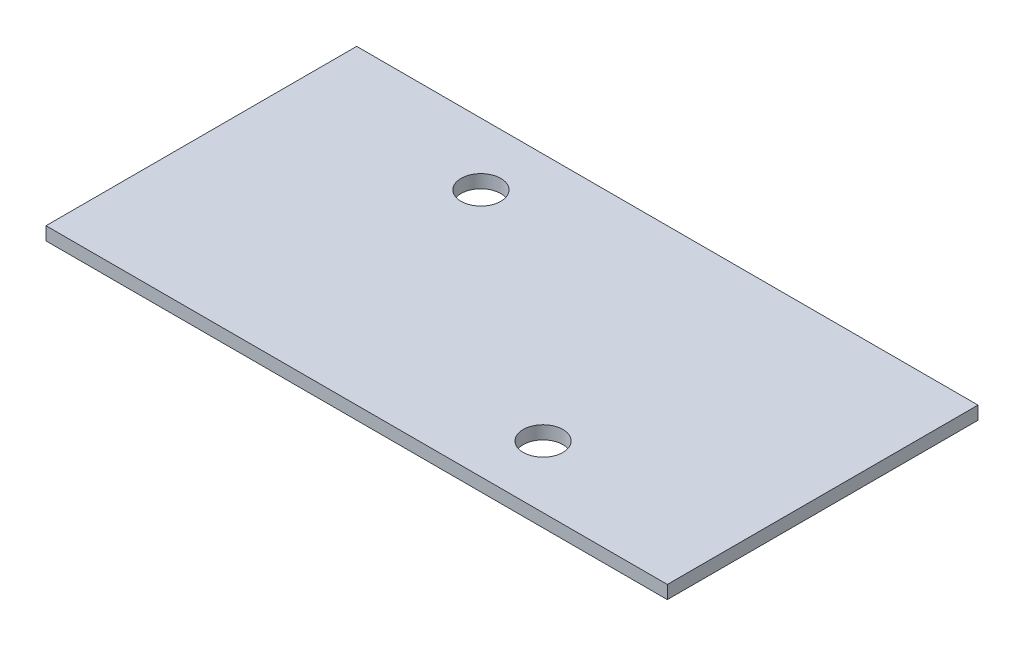
ISO-10303-21;
HEADER;
FILE_DESCRIPTION(('STEP AP214'),'2;1');
FILE_NAME('part.step','',(''),(''),'','','');
FILE_SCHEMA(('AUTOMOTIVE_DESIGN { 1 0 10303 214 1 1 1 1 }'));
ENDSEC;
DATA;
#1=APPLICATION_CONTEXT('core data for automotive mechanical design processes');
#2=APPLICATION_PROTOCOL_DEFINITION('international standard','automotive_design',2000,#1);
#3=PRODUCT_CONTEXT('',#1,'mechanical');
#4=PRODUCT('Part','Part','',(#3));
#5=PRODUCT_RELATED_PRODUCT_CATEGORY('part','',(#4));
#6=PRODUCT_DEFINITION_FORMATION('','',#4);
#7=PRODUCT_DEFINITION_CONTEXT('part definition',#1,'design');
#8=PRODUCT_DEFINITION('design','',#6,#7);
#9=PRODUCT_DEFINITION_SHAPE('','',#8);
#10=(LENGTH_UNIT() NAMED_UNIT(*) SI_UNIT(.MILLI.,.METRE.));
#11=(NAMED_UNIT(*) PLANE_ANGLE_UNIT() SI_UNIT($,.RADIAN.));
#12=(NAMED_UNIT(*) SI_UNIT($,.STERADIAN.) SOLID_ANGLE_UNIT());
#13=UNCERTAINTY_MEASURE_WITH_UNIT(LENGTH_MEASURE(1.E-05),#10,'distance_accuracy_value','');
#14=(GEOMETRIC_REPRESENTATION_CONTEXT(3) GLOBAL_UNCERTAINTY_ASSIGNED_CONTEXT((#13)) GLOBAL_UNIT_ASSIGNED_CONTEXT((#10,
#11,#12)) REPRESENTATION_CONTEXT('',''));
#15=CARTESIAN_POINT('',(0.,0.,0.));
#16=DIRECTION('',(0.,0.,1.));
#17=DIRECTION('',(1.,0.,0.));
#18=AXIS2_PLACEMENT_3D('',#15,#16,#17);
#19=CARTESIAN_POINT('',(25.,1.06,-12.5));
#20=DIRECTION('',(-1.,0.,0.));
#21=DIRECTION('',(0.,0.,1.));
#22=AXIS2_PLACEMENT_3D('',#19,#20,#21);
#23=PLANE('',#22);
#24=DIRECTION('',(0.,0.,-1.));
#25=VECTOR('',#24,1.);
#26=CARTESIAN_POINT('',(25.,0.,-12.5));
#27=LINE('',#26,#25);
#28=CARTESIAN_POINT('',(25.,0.,12.5));
#29=VERTEX_POINT('',#28);
#30=CARTESIAN_POINT('',(25.,0.,-12.5));
#31=VERTEX_POINT('',#30);
#32=EDGE_CURVE('E97',#29,#31,#27,.T.);
#33=ORIENTED_EDGE('',*,*,#32,.T.);
#34=DIRECTION('',(0.,-1.,0.));
#35=VECTOR('',#34,1.);
#36=CARTESIAN_POINT('',(25.,1.06,-12.5));
#37=LINE('',#36,#35);
#38=CARTESIAN_POINT('',(25.,1.06,-12.5));
#39=VERTEX_POINT('',#38);
#40=EDGE_CURVE('E11',#39,#31,#37,.T.);
#41=ORIENTED_EDGE('',*,*,#40,.F.);
#42=DIRECTION('',(0.,0.,-1.));
#43=VECTOR('',#42,1.);
#44=CARTESIAN_POINT('',(25.,1.06,-12.5));
#45=LINE('',#44,#43);
#46=CARTESIAN_POINT('',(25.,1.06,12.5));
#47=VERTEX_POINT('',#46);
#48=EDGE_CURVE('E85',#47,#39,#45,.T.);
#49=ORIENTED_EDGE('',*,*,#48,.F.);
#50=DIRECTION('',(0.,-1.,0.));
#51=VECTOR('',#50,1.);
#52=CARTESIAN_POINT('',(25.,1.06,12.5));
#53=LINE('',#52,#51);
#54=EDGE_CURVE('E93',#47,#29,#53,.T.);
#55=ORIENTED_EDGE('',*,*,#54,.T.);
#56=EDGE_LOOP('',(#33,#41,#49,#55));
#57=FACE_BOUND('',#56,.T.);
#58=ADVANCED_FACE('F34',(#57),#23,.F.);
#59=CARTESIAN_POINT('',(-25.,1.06,-12.5));
#60=DIRECTION('',(0.,0.,1.));
#61=DIRECTION('',(1.,0.,0.));
#62=AXIS2_PLACEMENT_3D('',#59,#60,#61);
#63=PLANE('',#62);
#64=DIRECTION('',(-1.,0.,0.));
#65=VECTOR('',#64,1.);
#66=CARTESIAN_POINT('',(-25.,0.,-12.5));
#67=LINE('',#66,#65);
#68=CARTESIAN_POINT('',(-25.,0.,-12.5));
#69=VERTEX_POINT('',#68);
#70=EDGE_CURVE('E89',#31,#69,#67,.T.);
#71=ORIENTED_EDGE('',*,*,#70,.T.);
#72=DIRECTION('',(0.,-1.,0.));
#73=VECTOR('',#72,1.);
#74=CARTESIAN_POINT('',(-25.,1.06,-12.5));
#75=LINE('',#74,#73);
#76=CARTESIAN_POINT('',(-25.,1.06,-12.5));
#77=VERTEX_POINT('',#76);
#78=EDGE_CURVE('E42',#77,#69,#75,.T.);
#79=ORIENTED_EDGE('',*,*,#78,.F.);
#80=DIRECTION('',(-1.,0.,0.));
#81=VECTOR('',#80,1.);
#82=CARTESIAN_POINT('',(-25.,1.06,-12.5));
#83=LINE('',#82,#81);
#84=EDGE_CURVE('E80',#39,#77,#83,.T.);
#85=ORIENTED_EDGE('',*,*,#84,.F.);
#86=ORIENTED_EDGE('',*,*,#40,.T.);
#87=EDGE_LOOP('',(#71,#79,#85,#86));
#88=FACE_BOUND('',#87,.T.);
#89=ADVANCED_FACE('F88',(#88),#63,.F.);
#90=CARTESIAN_POINT('',(-25.,1.06,-12.5));
#91=DIRECTION('',(1.,0.,0.));
#92=DIRECTION('',(0.,0.,-1.));
#93=AXIS2_PLACEMENT_3D('',#90,#91,#92);
#94=PLANE('',#93);
#95=DIRECTION('',(0.,0.,1.));
#96=VECTOR('',#95,1.);
#97=CARTESIAN_POINT('',(-25.,0.,-12.5));
#98=LINE('',#97,#96);
#99=CARTESIAN_POINT('',(-25.,0.,12.5));
#100=VERTEX_POINT('',#99);
#101=EDGE_CURVE('E67',#69,#100,#98,.T.);
#102=ORIENTED_EDGE('',*,*,#101,.T.);
#103=DIRECTION('',(0.,-1.,0.));
#104=VECTOR('',#103,1.);
#105=CARTESIAN_POINT('',(-25.,1.06,12.5));
#106=LINE('',#105,#104);
#107=CARTESIAN_POINT('',(-25.,1.06,12.5));
#108=VERTEX_POINT('',#107);
#109=EDGE_CURVE('E90',#108,#100,#106,.T.);
#110=ORIENTED_EDGE('',*,*,#109,.F.);
#111=DIRECTION('',(0.,0.,1.));
#112=VECTOR('',#111,1.);
#113=CARTESIAN_POINT('',(-25.,1.06,-12.5));
#114=LINE('',#113,#112);
#115=EDGE_CURVE('E83',#77,#108,#114,.T.);
#116=ORIENTED_EDGE('',*,*,#115,.F.);
#117=ORIENTED_EDGE('',*,*,#78,.T.);
#118=EDGE_LOOP('',(#102,#110,#116,#117));
#119=FACE_BOUND('',#118,.T.);
#120=ADVANCED_FACE('F91',(#119),#94,.F.);
#121=CARTESIAN_POINT('',(-25.,1.06,12.5));
#122=DIRECTION('',(0.,0.,-1.));
#123=DIRECTION('',(-1.,0.,0.));
#124=AXIS2_PLACEMENT_3D('',#121,#122,#123);
#125=PLANE('',#124);
#126=DIRECTION('',(1.,0.,0.));
#127=VECTOR('',#126,1.);
#128=CARTESIAN_POINT('',(-25.,0.,12.5));
#129=LINE('',#128,#127);
#130=EDGE_CURVE('E73',#100,#29,#129,.T.);
#131=ORIENTED_EDGE('',*,*,#130,.T.);
#132=ORIENTED_EDGE('',*,*,#54,.F.);
#133=DIRECTION('',(1.,0.,0.));
#134=VECTOR('',#133,1.);
#135=CARTESIAN_POINT('',(-25.,1.06,12.5));
#136=LINE('',#135,#134);
#137=EDGE_CURVE('E50',#108,#47,#136,.T.);
#138=ORIENTED_EDGE('',*,*,#137,.F.);
#139=ORIENTED_EDGE('',*,*,#109,.T.);
#140=EDGE_LOOP('',(#131,#132,#138,#139));
#141=FACE_BOUND('',#140,.T.);
#142=ADVANCED_FACE('F105',(#141),#125,.F.);
#143=CARTESIAN_POINT('',(0.,1.06,0.));
#144=DIRECTION('',(0.,1.,0.));
#145=DIRECTION('',(0.,0.,1.));
#146=AXIS2_PLACEMENT_3D('',#143,#144,#145);
#147=PLANE('',#146);
#148=CARTESIAN_POINT('',(10.,1.06,7.5));
#149=DIRECTION('',(0.,1.,0.));
#150=DIRECTION('',(0.,0.,1.));
#151=AXIS2_PLACEMENT_3D('',#148,#149,#150);
#152=CIRCLE('',#151,1.6);
#153=CARTESIAN_POINT('',(10.,1.06,9.1));
#154=VERTEX_POINT('',#153);
#155=EDGE_CURVE('E117',#154,#154,#152,.T.);
#156=ORIENTED_EDGE('',*,*,#155,.F.);
#157=EDGE_LOOP('',(#156));
#158=FACE_BOUND('',#157,.T.);
#159=CARTESIAN_POINT('',(-10.,1.06,-7.5));
#160=DIRECTION('',(0.,1.,0.));
#161=DIRECTION('',(0.,0.,1.));
#162=AXIS2_PLACEMENT_3D('',#159,#160,#161);
#163=CIRCLE('',#162,1.6);
#164=CARTESIAN_POINT('',(-10.,1.06,-5.9));
#165=VERTEX_POINT('',#164);
#166=EDGE_CURVE('E111',#165,#165,#163,.T.);
#167=ORIENTED_EDGE('',*,*,#166,.F.);
#168=EDGE_LOOP('',(#167));
#169=FACE_BOUND('',#168,.T.);
#170=ORIENTED_EDGE('',*,*,#48,.T.);
#171=ORIENTED_EDGE('',*,*,#84,.T.);
#172=ORIENTED_EDGE('',*,*,#115,.T.);
#173=ORIENTED_EDGE('',*,*,#137,.T.);
#174=EDGE_LOOP('',(#170,#171,#172,#173));
#175=FACE_BOUND('',#174,.T.);
#176=ADVANCED_FACE('F81',(#158,#169,#175),#147,.T.);
#177=CARTESIAN_POINT('',(0.,0.,0.));
#178=DIRECTION('',(0.,1.,0.));
#179=DIRECTION('',(0.,0.,1.));
#180=AXIS2_PLACEMENT_3D('',#177,#178,#179);
#181=PLANE('',#180);
#182=CARTESIAN_POINT('',(10.,0.,7.5));
#183=DIRECTION('',(0.,1.,0.));
#184=DIRECTION('',(0.,0.,1.));
#185=AXIS2_PLACEMENT_3D('',#182,#183,#184);
#186=CIRCLE('',#185,1.6);
#187=CARTESIAN_POINT('',(10.,0.,9.1));
#188=VERTEX_POINT('',#187);
#189=EDGE_CURVE('E114',#188,#188,#186,.T.);
#190=ORIENTED_EDGE('',*,*,#189,.T.);
#191=EDGE_LOOP('',(#190));
#192=FACE_BOUND('',#191,.T.);
#193=CARTESIAN_POINT('',(-10.,0.,-7.5));
#194=DIRECTION('',(0.,1.,0.));
#195=DIRECTION('',(0.,0.,1.));
#196=AXIS2_PLACEMENT_3D('',#193,#194,#195);
#197=CIRCLE('',#196,1.6);
#198=CARTESIAN_POINT('',(-10.,0.,-5.9));
#199=VERTEX_POINT('',#198);
#200=EDGE_CURVE('E100',#199,#199,#197,.T.);
#201=ORIENTED_EDGE('',*,*,#200,.T.);
#202=EDGE_LOOP('',(#201));
#203=FACE_BOUND('',#202,.T.);
#204=ORIENTED_EDGE('',*,*,#32,.F.);
#205=ORIENTED_EDGE('',*,*,#130,.F.);
#206=ORIENTED_EDGE('',*,*,#101,.F.);
#207=ORIENTED_EDGE('',*,*,#70,.F.);
#208=EDGE_LOOP('',(#204,#205,#206,#207));
#209=FACE_BOUND('',#208,.T.);
#210=ADVANCED_FACE('F108',(#192,#203,#209),#181,.F.);
#211=CARTESIAN_POINT('',(-10.,0.,-7.5));
#212=DIRECTION('',(0.,1.,0.));
#213=DIRECTION('',(0.,0.,1.));
#214=AXIS2_PLACEMENT_3D('',#211,#212,#213);
#215=CYLINDRICAL_SURFACE('',#214,1.6);
#216=ORIENTED_EDGE('',*,*,#200,.F.);
#217=EDGE_LOOP('',(#216));
#218=FACE_BOUND('',#217,.T.);
#219=ORIENTED_EDGE('',*,*,#166,.T.);
#220=EDGE_LOOP('',(#219));
#221=FACE_BOUND('',#220,.T.);
#222=ADVANCED_FACE('F128',(#218,#221),#215,.F.);
#223=CARTESIAN_POINT('',(10.,0.,7.5));
#224=DIRECTION('',(0.,1.,0.));
#225=DIRECTION('',(0.,0.,1.));
#226=AXIS2_PLACEMENT_3D('',#223,#224,#225);
#227=CYLINDRICAL_SURFACE('',#226,1.6);
#228=ORIENTED_EDGE('',*,*,#189,.F.);
#229=EDGE_LOOP('',(#228));
#230=FACE_BOUND('',#229,.T.);
#231=ORIENTED_EDGE('',*,*,#155,.T.);
#232=EDGE_LOOP('',(#231));
#233=FACE_BOUND('',#232,.T.);
#234=ADVANCED_FACE('F125',(#230,#233),#227,.F.);
#235=CLOSED_SHELL('',(#58,#89,#120,#142,#176,#210,#222,#234));
#236=MANIFOLD_SOLID_BREP('B2',#235);
#237=ADVANCED_BREP_SHAPE_REPRESENTATION('',(#18,#236),#14);
#238=SHAPE_DEFINITION_REPRESENTATION(#9,#237);
ENDSEC;
END-ISO-10303-21;
